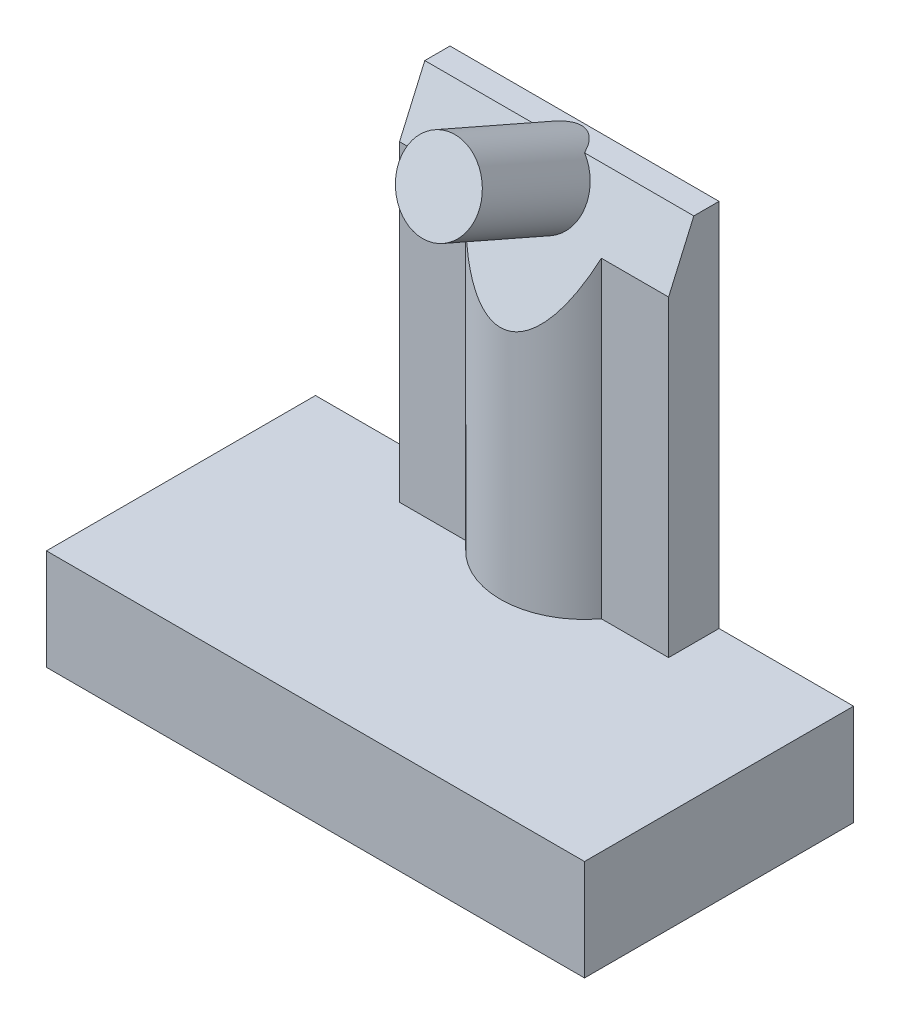
ISO-10303-21;
HEADER;
FILE_DESCRIPTION(('STEP AP214'),'2;1');
FILE_NAME('part.step','',(''),(''),'','','');
FILE_SCHEMA(('AUTOMOTIVE_DESIGN { 1 0 10303 214 1 1 1 1 }'));
ENDSEC;
DATA;
#1=APPLICATION_CONTEXT('core data for automotive mechanical design processes');
#2=APPLICATION_PROTOCOL_DEFINITION('international standard','automotive_design',2000,#1);
#3=PRODUCT_CONTEXT('',#1,'mechanical');
#4=PRODUCT('Part','Part','',(#3));
#5=PRODUCT_RELATED_PRODUCT_CATEGORY('part','',(#4));
#6=PRODUCT_DEFINITION_FORMATION('','',#4);
#7=PRODUCT_DEFINITION_CONTEXT('part definition',#1,'design');
#8=PRODUCT_DEFINITION('design','',#6,#7);
#9=PRODUCT_DEFINITION_SHAPE('','',#8);
#10=(LENGTH_UNIT() NAMED_UNIT(*) SI_UNIT(.MILLI.,.METRE.));
#11=(NAMED_UNIT(*) PLANE_ANGLE_UNIT() SI_UNIT($,.RADIAN.));
#12=(NAMED_UNIT(*) SI_UNIT($,.STERADIAN.) SOLID_ANGLE_UNIT());
#13=UNCERTAINTY_MEASURE_WITH_UNIT(LENGTH_MEASURE(1.E-05),#10,'distance_accuracy_value','');
#14=(GEOMETRIC_REPRESENTATION_CONTEXT(3) GLOBAL_UNCERTAINTY_ASSIGNED_CONTEXT((#13)) GLOBAL_UNIT_ASSIGNED_CONTEXT((#10,
#11,#12)) REPRESENTATION_CONTEXT('',''));
#15=CARTESIAN_POINT('',(0.,0.,0.));
#16=DIRECTION('',(0.,0.,1.));
#17=DIRECTION('',(1.,0.,0.));
#18=AXIS2_PLACEMENT_3D('',#15,#16,#17);
#19=CARTESIAN_POINT('',(-8.,10.,-1.5));
#20=DIRECTION('',(0.,-0.400818834019708,-0.916157334902189));
#21=DIRECTION('',(0.,0.916157334902189,-0.400818834019708));
#22=AXIS2_PLACEMENT_3D('',#19,#20,#21);
#23=PLANE('',#22);
#24=CARTESIAN_POINT('',(0.,13.1428571428571,-2.875));
#25=DIRECTION('',(0.,0.400818834019708,0.916157334902189));
#26=DIRECTION('',(0.,-0.916157334902189,0.400818834019708));
#27=AXIS2_PLACEMENT_3D('',#24,#25,#26);
#28=CIRCLE('',#27,1.2);
#29=CARTESIAN_POINT('',(-0.751452674789961,14.,-3.25));
#30=VERTEX_POINT('',#29);
#31=CARTESIAN_POINT('',(0.751452674789962,14.,-3.25));
#32=VERTEX_POINT('',#31);
#33=EDGE_CURVE('E47',#30,#32,#28,.T.);
#34=ORIENTED_EDGE('',*,*,#33,.F.);
#35=DIRECTION('',(-1.,0.,0.));
#36=VECTOR('',#35,1.);
#37=CARTESIAN_POINT('',(0.,14.,-3.25));
#38=LINE('',#37,#36);
#39=CARTESIAN_POINT('',(-4.,14.,-3.25));
#40=VERTEX_POINT('',#39);
#41=EDGE_CURVE('E41',#30,#40,#38,.T.);
#42=ORIENTED_EDGE('',*,*,#41,.T.);
#43=DIRECTION('',(0.,0.916157334902189,-0.400818834019708));
#44=VECTOR('',#43,1.);
#45=CARTESIAN_POINT('',(-4.,14.2754098360656,-3.37049180327869));
#46=LINE('',#45,#44);
#47=CARTESIAN_POINT('',(-4.,12.2857142857143,-2.50000000000001));
#48=VERTEX_POINT('',#47);
#49=EDGE_CURVE('E160',#48,#40,#46,.T.);
#50=ORIENTED_EDGE('',*,*,#49,.F.);
#51=DIRECTION('',(-1.,0.,0.));
#52=VECTOR('',#51,1.);
#53=CARTESIAN_POINT('',(-4.00000000000001,12.2857142857143,-2.50000000000001));
#54=LINE('',#53,#52);
#55=CARTESIAN_POINT('',(-2.,12.2857142857143,-2.5));
#56=VERTEX_POINT('',#55);
#57=EDGE_CURVE('E157',#56,#48,#54,.T.);
#58=ORIENTED_EDGE('',*,*,#57,.F.);
#59=CARTESIAN_POINT('',(0.,15.7142857142857,-4.));
#60=DIRECTION('',(0.,-0.400818834019708,-0.916157334902189));
#61=DIRECTION('',(0.,-0.916157334902189,0.400818834019708));
#62=AXIS2_PLACEMENT_3D('',#59,#60,#61);
#63=ELLIPSE('',#62,6.23723185591892,2.5);
#64=CARTESIAN_POINT('',(2.,12.2857142857143,-2.5));
#65=VERTEX_POINT('',#64);
#66=EDGE_CURVE('E163',#65,#56,#63,.T.);
#67=ORIENTED_EDGE('',*,*,#66,.F.);
#68=DIRECTION('',(-1.,0.,0.));
#69=VECTOR('',#68,1.);
#70=CARTESIAN_POINT('',(4.,12.2857142857143,-2.5));
#71=LINE('',#70,#69);
#72=CARTESIAN_POINT('',(4.,12.2857142857143,-2.5));
#73=VERTEX_POINT('',#72);
#74=EDGE_CURVE('E165',#73,#65,#71,.T.);
#75=ORIENTED_EDGE('',*,*,#74,.F.);
#76=DIRECTION('',(0.,0.916157334902189,-0.400818834019708));
#77=VECTOR('',#76,1.);
#78=CARTESIAN_POINT('',(4.,10.,-1.5));
#79=LINE('',#78,#77);
#80=CARTESIAN_POINT('',(4.,14.,-3.25));
#81=VERTEX_POINT('',#80);
#82=EDGE_CURVE('E53',#73,#81,#79,.T.);
#83=ORIENTED_EDGE('',*,*,#82,.T.);
#84=EDGE_CURVE('E11',#81,#32,#38,.T.);
#85=ORIENTED_EDGE('',*,*,#84,.T.);
#86=EDGE_LOOP('',(#34,#42,#50,#58,#67,#75,#83,#85));
#87=FACE_BOUND('',#86,.T.);
#88=ADVANCED_FACE('F33',(#87),#23,.F.);
#89=CARTESIAN_POINT('',(-8.,3.,4.));
#90=DIRECTION('',(1.,0.,0.));
#91=DIRECTION('',(0.,0.,-1.));
#92=AXIS2_PLACEMENT_3D('',#89,#90,#91);
#93=PLANE('',#92);
#94=DIRECTION('',(0.,0.,1.));
#95=VECTOR('',#94,1.);
#96=CARTESIAN_POINT('',(-8.,0.,4.));
#97=LINE('',#96,#95);
#98=CARTESIAN_POINT('',(-8.,0.,-4.));
#99=VERTEX_POINT('',#98);
#100=CARTESIAN_POINT('',(-8.,0.,4.));
#101=VERTEX_POINT('',#100);
#102=EDGE_CURVE('E216',#99,#101,#97,.T.);
#103=ORIENTED_EDGE('',*,*,#102,.T.);
#104=DIRECTION('',(0.,-1.,0.));
#105=VECTOR('',#104,1.);
#106=CARTESIAN_POINT('',(-8.,3.,4.));
#107=LINE('',#106,#105);
#108=CARTESIAN_POINT('',(-8.,3.,4.));
#109=VERTEX_POINT('',#108);
#110=EDGE_CURVE('E271',#109,#101,#107,.T.);
#111=ORIENTED_EDGE('',*,*,#110,.F.);
#112=DIRECTION('',(0.,0.,1.));
#113=VECTOR('',#112,1.);
#114=CARTESIAN_POINT('',(-8.,3.,4.));
#115=LINE('',#114,#113);
#116=CARTESIAN_POINT('',(-8.,3.,-4.));
#117=VERTEX_POINT('',#116);
#118=EDGE_CURVE('E244',#117,#109,#115,.T.);
#119=ORIENTED_EDGE('',*,*,#118,.F.);
#120=DIRECTION('',(0.,-1.,0.));
#121=VECTOR('',#120,1.);
#122=CARTESIAN_POINT('',(-8.,3.,-4.));
#123=LINE('',#122,#121);
#124=EDGE_CURVE('E255',#117,#99,#123,.T.);
#125=ORIENTED_EDGE('',*,*,#124,.T.);
#126=EDGE_LOOP('',(#103,#111,#119,#125));
#127=FACE_BOUND('',#126,.T.);
#128=ADVANCED_FACE('F35',(#127),#93,.F.);
#129=CARTESIAN_POINT('',(8.,3.,4.));
#130=DIRECTION('',(0.,0.,-1.));
#131=DIRECTION('',(-1.,0.,0.));
#132=AXIS2_PLACEMENT_3D('',#129,#130,#131);
#133=PLANE('',#132);
#134=DIRECTION('',(1.,0.,0.));
#135=VECTOR('',#134,1.);
#136=CARTESIAN_POINT('',(8.,0.,4.));
#137=LINE('',#136,#135);
#138=CARTESIAN_POINT('',(8.,0.,4.));
#139=VERTEX_POINT('',#138);
#140=EDGE_CURVE('E258',#101,#139,#137,.T.);
#141=ORIENTED_EDGE('',*,*,#140,.T.);
#142=DIRECTION('',(0.,-1.,0.));
#143=VECTOR('',#142,1.);
#144=CARTESIAN_POINT('',(8.,3.,4.));
#145=LINE('',#144,#143);
#146=CARTESIAN_POINT('',(8.,3.,4.));
#147=VERTEX_POINT('',#146);
#148=EDGE_CURVE('E268',#147,#139,#145,.T.);
#149=ORIENTED_EDGE('',*,*,#148,.F.);
#150=DIRECTION('',(1.,0.,0.));
#151=VECTOR('',#150,1.);
#152=CARTESIAN_POINT('',(8.,3.,4.));
#153=LINE('',#152,#151);
#154=EDGE_CURVE('E247',#109,#147,#153,.T.);
#155=ORIENTED_EDGE('',*,*,#154,.F.);
#156=ORIENTED_EDGE('',*,*,#110,.T.);
#157=EDGE_LOOP('',(#141,#149,#155,#156));
#158=FACE_BOUND('',#157,.T.);
#159=ADVANCED_FACE('F322',(#158),#133,.F.);
#160=CARTESIAN_POINT('',(8.,3.,4.));
#161=DIRECTION('',(-1.,0.,0.));
#162=DIRECTION('',(0.,0.,1.));
#163=AXIS2_PLACEMENT_3D('',#160,#161,#162);
#164=PLANE('',#163);
#165=DIRECTION('',(0.,0.,-1.));
#166=VECTOR('',#165,1.);
#167=CARTESIAN_POINT('',(8.,0.,4.));
#168=LINE('',#167,#166);
#169=CARTESIAN_POINT('',(8.,0.,-4.));
#170=VERTEX_POINT('',#169);
#171=EDGE_CURVE('E260',#139,#170,#168,.T.);
#172=ORIENTED_EDGE('',*,*,#171,.T.);
#173=DIRECTION('',(0.,-1.,0.));
#174=VECTOR('',#173,1.);
#175=CARTESIAN_POINT('',(8.,3.,-4.));
#176=LINE('',#175,#174);
#177=CARTESIAN_POINT('',(8.,3.,-4.));
#178=VERTEX_POINT('',#177);
#179=EDGE_CURVE('E265',#178,#170,#176,.T.);
#180=ORIENTED_EDGE('',*,*,#179,.F.);
#181=DIRECTION('',(0.,0.,-1.));
#182=VECTOR('',#181,1.);
#183=CARTESIAN_POINT('',(8.,3.,4.));
#184=LINE('',#183,#182);
#185=EDGE_CURVE('E250',#147,#178,#184,.T.);
#186=ORIENTED_EDGE('',*,*,#185,.F.);
#187=ORIENTED_EDGE('',*,*,#148,.T.);
#188=EDGE_LOOP('',(#172,#180,#186,#187));
#189=FACE_BOUND('',#188,.T.);
#190=ADVANCED_FACE('F344',(#189),#164,.F.);
#191=CARTESIAN_POINT('',(8.,3.,-4.));
#192=DIRECTION('',(0.,0.,1.));
#193=DIRECTION('',(1.,0.,0.));
#194=AXIS2_PLACEMENT_3D('',#191,#192,#193);
#195=PLANE('',#194);
#196=DIRECTION('',(-1.,0.,0.));
#197=VECTOR('',#196,1.);
#198=CARTESIAN_POINT('',(8.,0.,-4.));
#199=LINE('',#198,#197);
#200=EDGE_CURVE('E248',#170,#99,#199,.T.);
#201=ORIENTED_EDGE('',*,*,#200,.T.);
#202=ORIENTED_EDGE('',*,*,#124,.F.);
#203=DIRECTION('',(-1.,0.,0.));
#204=VECTOR('',#203,1.);
#205=CARTESIAN_POINT('',(8.,3.,-4.));
#206=LINE('',#205,#204);
#207=CARTESIAN_POINT('',(-4.,3.,-4.));
#208=VERTEX_POINT('',#207);
#209=EDGE_CURVE('E252',#208,#117,#206,.T.);
#210=ORIENTED_EDGE('',*,*,#209,.F.);
#211=DIRECTION('',(0.,-1.,0.));
#212=VECTOR('',#211,1.);
#213=CARTESIAN_POINT('',(-4.,14.,-4.00000000000001));
#214=LINE('',#213,#212);
#215=CARTESIAN_POINT('',(-4.,14.,-4.00000000000001));
#216=VERTEX_POINT('',#215);
#217=EDGE_CURVE('E193',#216,#208,#214,.T.);
#218=ORIENTED_EDGE('',*,*,#217,.F.);
#219=DIRECTION('',(-1.,0.,0.));
#220=VECTOR('',#219,1.);
#221=CARTESIAN_POINT('',(-4.,14.,-4.00000000000001));
#222=LINE('',#221,#220);
#223=CARTESIAN_POINT('',(4.,14.,-4.));
#224=VERTEX_POINT('',#223);
#225=EDGE_CURVE('E171',#224,#216,#222,.T.);
#226=ORIENTED_EDGE('',*,*,#225,.F.);
#227=DIRECTION('',(0.,-1.,0.));
#228=VECTOR('',#227,1.);
#229=CARTESIAN_POINT('',(4.,14.,-4.));
#230=LINE('',#229,#228);
#231=CARTESIAN_POINT('',(4.,3.,-4.));
#232=VERTEX_POINT('',#231);
#233=EDGE_CURVE('E196',#224,#232,#230,.T.);
#234=ORIENTED_EDGE('',*,*,#233,.T.);
#235=EDGE_CURVE('E253',#178,#232,#206,.T.);
#236=ORIENTED_EDGE('',*,*,#235,.F.);
#237=ORIENTED_EDGE('',*,*,#179,.T.);
#238=EDGE_LOOP('',(#201,#202,#210,#218,#226,#234,#236,#237));
#239=FACE_BOUND('',#238,.T.);
#240=ADVANCED_FACE('F287',(#239),#195,.F.);
#241=CARTESIAN_POINT('',(0.,3.,0.));
#242=DIRECTION('',(0.,1.,0.));
#243=DIRECTION('',(0.,0.,1.));
#244=AXIS2_PLACEMENT_3D('',#241,#242,#243);
#245=PLANE('',#244);
#246=DIRECTION('',(0.,0.,1.));
#247=VECTOR('',#246,1.);
#248=CARTESIAN_POINT('',(-4.,3.,-4.00000000000001));
#249=LINE('',#248,#247);
#250=CARTESIAN_POINT('',(-4.,3.,-2.50000000000001));
#251=VERTEX_POINT('',#250);
#252=EDGE_CURVE('E185',#208,#251,#249,.T.);
#253=ORIENTED_EDGE('',*,*,#252,.F.);
#254=ORIENTED_EDGE('',*,*,#209,.T.);
#255=ORIENTED_EDGE('',*,*,#118,.T.);
#256=ORIENTED_EDGE('',*,*,#154,.T.);
#257=ORIENTED_EDGE('',*,*,#185,.T.);
#258=ORIENTED_EDGE('',*,*,#235,.T.);
#259=DIRECTION('',(0.,0.,-1.));
#260=VECTOR('',#259,1.);
#261=CARTESIAN_POINT('',(4.,3.,-4.));
#262=LINE('',#261,#260);
#263=CARTESIAN_POINT('',(4.,3.,-2.5));
#264=VERTEX_POINT('',#263);
#265=EDGE_CURVE('E182',#264,#232,#262,.T.);
#266=ORIENTED_EDGE('',*,*,#265,.F.);
#267=DIRECTION('',(1.,0.,0.));
#268=VECTOR('',#267,1.);
#269=CARTESIAN_POINT('',(4.,3.,-2.5));
#270=LINE('',#269,#268);
#271=CARTESIAN_POINT('',(2.,3.,-2.5));
#272=VERTEX_POINT('',#271);
#273=EDGE_CURVE('E179',#272,#264,#270,.T.);
#274=ORIENTED_EDGE('',*,*,#273,.F.);
#275=CARTESIAN_POINT('',(0.,3.,-4.));
#276=DIRECTION('',(0.,1.,0.));
#277=DIRECTION('',(0.,0.,1.));
#278=AXIS2_PLACEMENT_3D('',#275,#276,#277);
#279=CIRCLE('',#278,2.5);
#280=CARTESIAN_POINT('',(-2.,3.,-2.5));
#281=VERTEX_POINT('',#280);
#282=EDGE_CURVE('E168',#281,#272,#279,.T.);
#283=ORIENTED_EDGE('',*,*,#282,.F.);
#284=DIRECTION('',(1.,0.,0.));
#285=VECTOR('',#284,1.);
#286=CARTESIAN_POINT('',(-4.,3.,-2.50000000000001));
#287=LINE('',#286,#285);
#288=EDGE_CURVE('E172',#251,#281,#287,.T.);
#289=ORIENTED_EDGE('',*,*,#288,.F.);
#290=EDGE_LOOP('',(#253,#254,#255,#256,#257,#258,#266,#274,#283,#289));
#291=FACE_BOUND('',#290,.T.);
#292=ADVANCED_FACE('F291',(#291),#245,.T.);
#293=CARTESIAN_POINT('',(0.,0.,0.));
#294=DIRECTION('',(0.,1.,0.));
#295=DIRECTION('',(0.,0.,1.));
#296=AXIS2_PLACEMENT_3D('',#293,#294,#295);
#297=PLANE('',#296);
#298=DIRECTION('',(-1.,0.,0.));
#299=VECTOR('',#298,1.);
#300=CARTESIAN_POINT('',(8.,0.,-3.));
#301=LINE('',#300,#299);
#302=CARTESIAN_POINT('',(7.,0.,-3.));
#303=VERTEX_POINT('',#302);
#304=CARTESIAN_POINT('',(-7.,0.,-3.));
#305=VERTEX_POINT('',#304);
#306=EDGE_CURVE('E222',#303,#305,#301,.T.);
#307=ORIENTED_EDGE('',*,*,#306,.T.);
#308=DIRECTION('',(0.,0.,1.));
#309=VECTOR('',#308,1.);
#310=CARTESIAN_POINT('',(-7.,0.,4.));
#311=LINE('',#310,#309);
#312=CARTESIAN_POINT('',(-7.,0.,3.));
#313=VERTEX_POINT('',#312);
#314=EDGE_CURVE('E212',#305,#313,#311,.T.);
#315=ORIENTED_EDGE('',*,*,#314,.T.);
#316=DIRECTION('',(1.,0.,0.));
#317=VECTOR('',#316,1.);
#318=CARTESIAN_POINT('',(8.,0.,3.));
#319=LINE('',#318,#317);
#320=CARTESIAN_POINT('',(7.,0.,3.));
#321=VERTEX_POINT('',#320);
#322=EDGE_CURVE('E236',#313,#321,#319,.T.);
#323=ORIENTED_EDGE('',*,*,#322,.T.);
#324=DIRECTION('',(0.,0.,-1.));
#325=VECTOR('',#324,1.);
#326=CARTESIAN_POINT('',(7.,0.,4.));
#327=LINE('',#326,#325);
#328=EDGE_CURVE('E239',#321,#303,#327,.T.);
#329=ORIENTED_EDGE('',*,*,#328,.T.);
#330=EDGE_LOOP('',(#307,#315,#323,#329));
#331=FACE_BOUND('',#330,.T.);
#332=ORIENTED_EDGE('',*,*,#102,.F.);
#333=ORIENTED_EDGE('',*,*,#200,.F.);
#334=ORIENTED_EDGE('',*,*,#171,.F.);
#335=ORIENTED_EDGE('',*,*,#140,.F.);
#336=EDGE_LOOP('',(#332,#333,#334,#335));
#337=FACE_BOUND('',#336,.T.);
#338=ADVANCED_FACE('F348',(#331,#337),#297,.F.);
#339=CARTESIAN_POINT('',(-7.,3.,4.));
#340=DIRECTION('',(1.,0.,0.));
#341=DIRECTION('',(0.,0.,-1.));
#342=AXIS2_PLACEMENT_3D('',#339,#340,#341);
#343=PLANE('',#342);
#344=ORIENTED_EDGE('',*,*,#314,.F.);
#345=DIRECTION('',(0.,-1.,0.));
#346=VECTOR('',#345,1.);
#347=CARTESIAN_POINT('',(-7.,3.,-3.));
#348=LINE('',#347,#346);
#349=CARTESIAN_POINT('',(-7.,2.,-3.));
#350=VERTEX_POINT('',#349);
#351=EDGE_CURVE('E223',#350,#305,#348,.T.);
#352=ORIENTED_EDGE('',*,*,#351,.F.);
#353=DIRECTION('',(0.,0.,1.));
#354=VECTOR('',#353,1.);
#355=CARTESIAN_POINT('',(-7.,2.,4.));
#356=LINE('',#355,#354);
#357=CARTESIAN_POINT('',(-7.,2.,3.));
#358=VERTEX_POINT('',#357);
#359=EDGE_CURVE('E218',#350,#358,#356,.T.);
#360=ORIENTED_EDGE('',*,*,#359,.T.);
#361=DIRECTION('',(0.,-1.,0.));
#362=VECTOR('',#361,1.);
#363=CARTESIAN_POINT('',(-7.,3.,3.));
#364=LINE('',#363,#362);
#365=EDGE_CURVE('E213',#358,#313,#364,.T.);
#366=ORIENTED_EDGE('',*,*,#365,.T.);
#367=EDGE_LOOP('',(#344,#352,#360,#366));
#368=FACE_BOUND('',#367,.T.);
#369=ADVANCED_FACE('F362',(#368),#343,.T.);
#370=CARTESIAN_POINT('',(8.,3.,3.));
#371=DIRECTION('',(0.,0.,-1.));
#372=DIRECTION('',(-1.,0.,0.));
#373=AXIS2_PLACEMENT_3D('',#370,#371,#372);
#374=PLANE('',#373);
#375=ORIENTED_EDGE('',*,*,#322,.F.);
#376=ORIENTED_EDGE('',*,*,#365,.F.);
#377=DIRECTION('',(1.,0.,0.));
#378=VECTOR('',#377,1.);
#379=CARTESIAN_POINT('',(8.,2.,3.));
#380=LINE('',#379,#378);
#381=CARTESIAN_POINT('',(7.,2.,3.));
#382=VERTEX_POINT('',#381);
#383=EDGE_CURVE('E221',#358,#382,#380,.T.);
#384=ORIENTED_EDGE('',*,*,#383,.T.);
#385=DIRECTION('',(0.,-1.,0.));
#386=VECTOR('',#385,1.);
#387=CARTESIAN_POINT('',(7.,3.,3.));
#388=LINE('',#387,#386);
#389=EDGE_CURVE('E217',#382,#321,#388,.T.);
#390=ORIENTED_EDGE('',*,*,#389,.T.);
#391=EDGE_LOOP('',(#375,#376,#384,#390));
#392=FACE_BOUND('',#391,.T.);
#393=ADVANCED_FACE('F376',(#392),#374,.T.);
#394=CARTESIAN_POINT('',(7.,3.,4.));
#395=DIRECTION('',(-1.,0.,0.));
#396=DIRECTION('',(0.,0.,1.));
#397=AXIS2_PLACEMENT_3D('',#394,#395,#396);
#398=PLANE('',#397);
#399=ORIENTED_EDGE('',*,*,#328,.F.);
#400=ORIENTED_EDGE('',*,*,#389,.F.);
#401=DIRECTION('',(0.,0.,-1.));
#402=VECTOR('',#401,1.);
#403=CARTESIAN_POINT('',(7.,2.,4.));
#404=LINE('',#403,#402);
#405=CARTESIAN_POINT('',(7.,2.,-3.));
#406=VERTEX_POINT('',#405);
#407=EDGE_CURVE('E230',#382,#406,#404,.T.);
#408=ORIENTED_EDGE('',*,*,#407,.T.);
#409=DIRECTION('',(0.,-1.,0.));
#410=VECTOR('',#409,1.);
#411=CARTESIAN_POINT('',(7.,3.,-3.));
#412=LINE('',#411,#410);
#413=EDGE_CURVE('E225',#406,#303,#412,.T.);
#414=ORIENTED_EDGE('',*,*,#413,.T.);
#415=EDGE_LOOP('',(#399,#400,#408,#414));
#416=FACE_BOUND('',#415,.T.);
#417=ADVANCED_FACE('F372',(#416),#398,.T.);
#418=CARTESIAN_POINT('',(8.,3.,-3.));
#419=DIRECTION('',(0.,0.,1.));
#420=DIRECTION('',(1.,0.,0.));
#421=AXIS2_PLACEMENT_3D('',#418,#419,#420);
#422=PLANE('',#421);
#423=ORIENTED_EDGE('',*,*,#306,.F.);
#424=ORIENTED_EDGE('',*,*,#413,.F.);
#425=DIRECTION('',(-1.,0.,0.));
#426=VECTOR('',#425,1.);
#427=CARTESIAN_POINT('',(8.,2.,-3.));
#428=LINE('',#427,#426);
#429=EDGE_CURVE('E226',#406,#350,#428,.T.);
#430=ORIENTED_EDGE('',*,*,#429,.T.);
#431=ORIENTED_EDGE('',*,*,#351,.T.);
#432=EDGE_LOOP('',(#423,#424,#430,#431));
#433=FACE_BOUND('',#432,.T.);
#434=ADVANCED_FACE('F368',(#433),#422,.T.);
#435=CARTESIAN_POINT('',(0.,2.,0.));
#436=DIRECTION('',(0.,1.,0.));
#437=DIRECTION('',(0.,0.,1.));
#438=AXIS2_PLACEMENT_3D('',#435,#436,#437);
#439=PLANE('',#438);
#440=CARTESIAN_POINT('',(0.,2.,0.));
#441=DIRECTION('',(0.,1.,0.));
#442=DIRECTION('',(0.,0.,1.));
#443=AXIS2_PLACEMENT_3D('',#440,#441,#442);
#444=CIRCLE('',#443,1.5);
#445=CARTESIAN_POINT('',(0.,2.,1.5));
#446=VERTEX_POINT('',#445);
#447=EDGE_CURVE('E273',#446,#446,#444,.F.);
#448=ORIENTED_EDGE('',*,*,#447,.F.);
#449=EDGE_LOOP('',(#448));
#450=FACE_BOUND('',#449,.T.);
#451=ORIENTED_EDGE('',*,*,#359,.F.);
#452=ORIENTED_EDGE('',*,*,#429,.F.);
#453=ORIENTED_EDGE('',*,*,#407,.F.);
#454=ORIENTED_EDGE('',*,*,#383,.F.);
#455=EDGE_LOOP('',(#451,#452,#453,#454));
#456=FACE_BOUND('',#455,.T.);
#457=ADVANCED_FACE('F315',(#450,#456),#439,.F.);
#458=CARTESIAN_POINT('',(0.,0.,0.));
#459=DIRECTION('',(0.,-1.,0.));
#460=DIRECTION('',(0.,0.,-1.));
#461=AXIS2_PLACEMENT_3D('',#458,#459,#460);
#462=PLANE('',#461);
#463=CARTESIAN_POINT('',(0.,0.,0.));
#464=DIRECTION('',(0.,-1.,0.));
#465=DIRECTION('',(0.,0.,-1.));
#466=AXIS2_PLACEMENT_3D('',#463,#464,#465);
#467=CIRCLE('',#466,1.5);
#468=CARTESIAN_POINT('',(0.,0.,-1.5));
#469=VERTEX_POINT('',#468);
#470=EDGE_CURVE('E207',#469,#469,#467,.T.);
#471=ORIENTED_EDGE('',*,*,#470,.T.);
#472=EDGE_LOOP('',(#471));
#473=FACE_BOUND('',#472,.T.);
#474=CARTESIAN_POINT('',(0.,0.,0.));
#475=DIRECTION('',(0.,-1.,0.));
#476=DIRECTION('',(0.,0.,-1.));
#477=AXIS2_PLACEMENT_3D('',#474,#475,#476);
#478=CIRCLE('',#477,0.8);
#479=CARTESIAN_POINT('',(0.,0.,-0.8));
#480=VERTEX_POINT('',#479);
#481=EDGE_CURVE('E204',#480,#480,#478,.T.);
#482=ORIENTED_EDGE('',*,*,#481,.F.);
#483=EDGE_LOOP('',(#482));
#484=FACE_BOUND('',#483,.T.);
#485=ADVANCED_FACE('F367',(#473,#484),#462,.T.);
#486=CARTESIAN_POINT('',(0.,0.,0.));
#487=DIRECTION('',(0.,1.,0.));
#488=DIRECTION('',(0.,0.,1.));
#489=AXIS2_PLACEMENT_3D('',#486,#487,#488);
#490=CYLINDRICAL_SURFACE('',#489,1.5);
#491=ORIENTED_EDGE('',*,*,#470,.F.);
#492=EDGE_LOOP('',(#491));
#493=FACE_BOUND('',#492,.T.);
#494=ORIENTED_EDGE('',*,*,#447,.T.);
#495=EDGE_LOOP('',(#494));
#496=FACE_BOUND('',#495,.T.);
#497=ADVANCED_FACE('F384',(#493,#496),#490,.T.);
#498=CARTESIAN_POINT('',(0.,0.,0.));
#499=DIRECTION('',(0.,1.,0.));
#500=DIRECTION('',(0.,0.,1.));
#501=AXIS2_PLACEMENT_3D('',#498,#499,#500);
#502=CYLINDRICAL_SURFACE('',#501,0.8);
#503=ORIENTED_EDGE('',*,*,#481,.T.);
#504=EDGE_LOOP('',(#503));
#505=FACE_BOUND('',#504,.T.);
#506=CARTESIAN_POINT('',(0.,2.,0.));
#507=DIRECTION('',(0.,-1.,0.));
#508=DIRECTION('',(0.,0.,-1.));
#509=AXIS2_PLACEMENT_3D('',#506,#507,#508);
#510=CIRCLE('',#509,0.8);
#511=CARTESIAN_POINT('',(0.,2.,-0.8));
#512=VERTEX_POINT('',#511);
#513=EDGE_CURVE('E203',#512,#512,#510,.T.);
#514=ORIENTED_EDGE('',*,*,#513,.F.);
#515=EDGE_LOOP('',(#514));
#516=FACE_BOUND('',#515,.T.);
#517=ADVANCED_FACE('F312',(#505,#516),#502,.F.);
#518=ORIENTED_EDGE('',*,*,#513,.T.);
#519=EDGE_LOOP('',(#518));
#520=FACE_BOUND('',#519,.T.);
#521=ADVANCED_FACE('F304',(#520),#439,.F.);
#522=CARTESIAN_POINT('',(0.,14.,-4.));
#523=DIRECTION('',(0.,-1.,0.));
#524=DIRECTION('',(0.,0.,-1.));
#525=AXIS2_PLACEMENT_3D('',#522,#523,#524);
#526=CYLINDRICAL_SURFACE('',#525,2.5);
#527=ORIENTED_EDGE('',*,*,#66,.T.);
#528=DIRECTION('',(0.,-1.,0.));
#529=VECTOR('',#528,1.);
#530=CARTESIAN_POINT('',(-2.,14.,-2.5));
#531=LINE('',#530,#529);
#532=EDGE_CURVE('E176',#56,#281,#531,.T.);
#533=ORIENTED_EDGE('',*,*,#532,.T.);
#534=ORIENTED_EDGE('',*,*,#282,.T.);
#535=DIRECTION('',(0.,-1.,0.));
#536=VECTOR('',#535,1.);
#537=CARTESIAN_POINT('',(2.,14.,-2.5));
#538=LINE('',#537,#536);
#539=EDGE_CURVE('E201',#65,#272,#538,.T.);
#540=ORIENTED_EDGE('',*,*,#539,.F.);
#541=EDGE_LOOP('',(#527,#533,#534,#540));
#542=FACE_BOUND('',#541,.T.);
#543=ADVANCED_FACE('F302',(#542),#526,.T.);
#544=CARTESIAN_POINT('',(4.,14.,-2.5));
#545=DIRECTION('',(0.,0.,-1.));
#546=DIRECTION('',(-1.,0.,0.));
#547=AXIS2_PLACEMENT_3D('',#544,#545,#546);
#548=PLANE('',#547);
#549=DIRECTION('',(0.,-1.,0.));
#550=VECTOR('',#549,1.);
#551=CARTESIAN_POINT('',(4.,14.,-2.5));
#552=LINE('',#551,#550);
#553=EDGE_CURVE('E199',#73,#264,#552,.T.);
#554=ORIENTED_EDGE('',*,*,#553,.F.);
#555=ORIENTED_EDGE('',*,*,#74,.T.);
#556=ORIENTED_EDGE('',*,*,#539,.T.);
#557=ORIENTED_EDGE('',*,*,#273,.T.);
#558=EDGE_LOOP('',(#554,#555,#556,#557));
#559=FACE_BOUND('',#558,.T.);
#560=ADVANCED_FACE('F301',(#559),#548,.F.);
#561=CARTESIAN_POINT('',(4.,14.,-4.));
#562=DIRECTION('',(-1.,0.,0.));
#563=DIRECTION('',(0.,0.,1.));
#564=AXIS2_PLACEMENT_3D('',#561,#562,#563);
#565=PLANE('',#564);
#566=DIRECTION('',(0.,0.,-1.));
#567=VECTOR('',#566,1.);
#568=CARTESIAN_POINT('',(4.,14.,-4.));
#569=LINE('',#568,#567);
#570=EDGE_CURVE('E169',#81,#224,#569,.T.);
#571=ORIENTED_EDGE('',*,*,#570,.F.);
#572=ORIENTED_EDGE('',*,*,#82,.F.);
#573=ORIENTED_EDGE('',*,*,#553,.T.);
#574=ORIENTED_EDGE('',*,*,#265,.T.);
#575=ORIENTED_EDGE('',*,*,#233,.F.);
#576=EDGE_LOOP('',(#571,#572,#573,#574,#575));
#577=FACE_BOUND('',#576,.T.);
#578=ADVANCED_FACE('F310',(#577),#565,.F.);
#579=CARTESIAN_POINT('',(-4.,14.,-4.00000000000001));
#580=DIRECTION('',(1.,0.,0.));
#581=DIRECTION('',(0.,0.,-1.));
#582=AXIS2_PLACEMENT_3D('',#579,#580,#581);
#583=PLANE('',#582);
#584=DIRECTION('',(0.,-1.,0.));
#585=VECTOR('',#584,1.);
#586=CARTESIAN_POINT('',(-4.,14.,-2.50000000000001));
#587=LINE('',#586,#585);
#588=EDGE_CURVE('E191',#48,#251,#587,.T.);
#589=ORIENTED_EDGE('',*,*,#588,.F.);
#590=ORIENTED_EDGE('',*,*,#49,.T.);
#591=DIRECTION('',(0.,0.,1.));
#592=VECTOR('',#591,1.);
#593=CARTESIAN_POINT('',(-4.,14.,-4.00000000000001));
#594=LINE('',#593,#592);
#595=EDGE_CURVE('E174',#216,#40,#594,.T.);
#596=ORIENTED_EDGE('',*,*,#595,.F.);
#597=ORIENTED_EDGE('',*,*,#217,.T.);
#598=ORIENTED_EDGE('',*,*,#252,.T.);
#599=EDGE_LOOP('',(#589,#590,#596,#597,#598));
#600=FACE_BOUND('',#599,.T.);
#601=ADVANCED_FACE('F281',(#600),#583,.F.);
#602=CARTESIAN_POINT('',(-4.,14.,-2.50000000000001));
#603=DIRECTION('',(0.,0.,-1.));
#604=DIRECTION('',(-1.,0.,0.));
#605=AXIS2_PLACEMENT_3D('',#602,#603,#604);
#606=PLANE('',#605);
#607=ORIENTED_EDGE('',*,*,#532,.F.);
#608=ORIENTED_EDGE('',*,*,#57,.T.);
#609=ORIENTED_EDGE('',*,*,#588,.T.);
#610=ORIENTED_EDGE('',*,*,#288,.T.);
#611=EDGE_LOOP('',(#607,#608,#609,#610));
#612=FACE_BOUND('',#611,.T.);
#613=ADVANCED_FACE('F296',(#612),#606,.F.);
#614=CARTESIAN_POINT('',(0.,14.,-4.));
#615=DIRECTION('',(0.,1.,0.));
#616=DIRECTION('',(0.,0.,1.));
#617=AXIS2_PLACEMENT_3D('',#614,#615,#616);
#618=PLANE('',#617);
#619=ORIENTED_EDGE('',*,*,#41,.F.);
#620=CARTESIAN_POINT('',(0.,14.,-0.915816326530622));
#621=DIRECTION('',(0.,1.,0.));
#622=DIRECTION('',(0.,0.,1.));
#623=AXIS2_PLACEMENT_3D('',#620,#621,#622);
#624=ELLIPSE('',#623,2.99387129084108,1.2);
#625=EDGE_CURVE('E145',#30,#32,#624,.F.);
#626=ORIENTED_EDGE('',*,*,#625,.T.);
#627=ORIENTED_EDGE('',*,*,#84,.F.);
#628=ORIENTED_EDGE('',*,*,#570,.T.);
#629=ORIENTED_EDGE('',*,*,#225,.T.);
#630=ORIENTED_EDGE('',*,*,#595,.T.);
#631=EDGE_LOOP('',(#619,#626,#627,#628,#629,#630));
#632=FACE_BOUND('',#631,.T.);
#633=ADVANCED_FACE('F146',(#632),#618,.T.);
#634=CARTESIAN_POINT('',(0.,14.5457230619261,0.331550672157661));
#635=DIRECTION('',(0.,-0.400818834019708,-0.916157334902189));
#636=DIRECTION('',(0.,0.916157334902189,-0.400818834019708));
#637=AXIS2_PLACEMENT_3D('',#634,#635,#636);
#638=CYLINDRICAL_SURFACE('',#637,1.2);
#639=CARTESIAN_POINT('',(0.,14.5457230619261,0.331550672157661));
#640=DIRECTION('',(0.,0.400818834019708,0.916157334902189));
#641=DIRECTION('',(0.,-0.916157334902189,0.400818834019708));
#642=AXIS2_PLACEMENT_3D('',#639,#640,#641);
#643=CIRCLE('',#642,1.2);
#644=CARTESIAN_POINT('',(0.,13.4463342600435,0.81253327298131));
#645=VERTEX_POINT('',#644);
#646=EDGE_CURVE('E151',#645,#645,#643,.T.);
#647=ORIENTED_EDGE('',*,*,#646,.F.);
#648=EDGE_LOOP('',(#647));
#649=FACE_BOUND('',#648,.T.);
#650=ORIENTED_EDGE('',*,*,#33,.T.);
#651=ORIENTED_EDGE('',*,*,#625,.F.);
#652=EDGE_LOOP('',(#650,#651));
#653=FACE_BOUND('',#652,.T.);
#654=ADVANCED_FACE('F150',(#649,#653),#638,.T.);
#655=CARTESIAN_POINT('',(0.,14.5457230619261,0.331550672157661));
#656=DIRECTION('',(0.,0.400818834019708,0.916157334902189));
#657=DIRECTION('',(0.,-0.916157334902189,0.400818834019708));
#658=AXIS2_PLACEMENT_3D('',#655,#656,#657);
#659=PLANE('',#658);
#660=ORIENTED_EDGE('',*,*,#646,.T.);
#661=EDGE_LOOP('',(#660));
#662=FACE_BOUND('',#661,.T.);
#663=ADVANCED_FACE('F465',(#662),#659,.T.);
#664=CLOSED_SHELL('',(#88,#128,#159,#190,#240,#292,#338,#369,#393,#417,#434,#457,#485,#497,#517,
#521,#543,#560,#578,#601,#613,#633,#654,#663));
#665=MANIFOLD_SOLID_BREP('B2',#664);
#666=ADVANCED_BREP_SHAPE_REPRESENTATION('',(#18,#665),#14);
#667=SHAPE_DEFINITION_REPRESENTATION(#9,#666);
ENDSEC;
END-ISO-10303-21;
